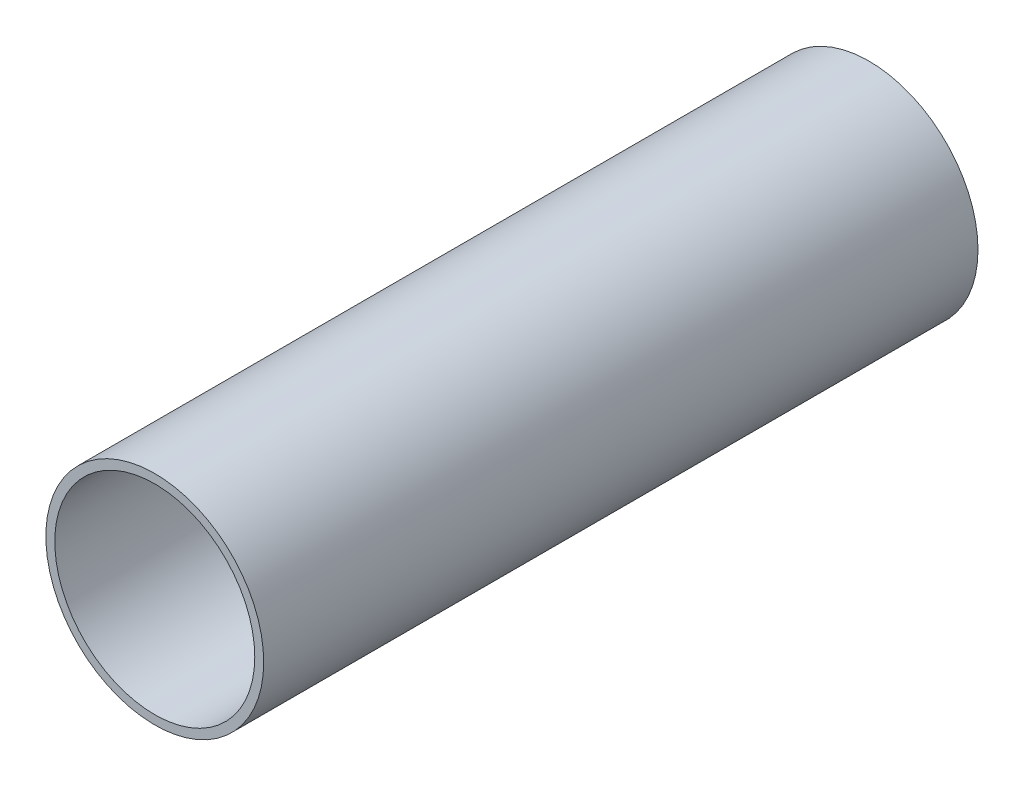
ISO-10303-21;
HEADER;
FILE_DESCRIPTION(('STEP AP214'),'2;1');
FILE_NAME('part.step','',(''),(''),'','','');
FILE_SCHEMA(('AUTOMOTIVE_DESIGN { 1 0 10303 214 1 1 1 1 }'));
ENDSEC;
DATA;
#1=APPLICATION_CONTEXT('core data for automotive mechanical design processes');
#2=APPLICATION_PROTOCOL_DEFINITION('international standard','automotive_design',2000,#1);
#3=PRODUCT_CONTEXT('',#1,'mechanical');
#4=PRODUCT('Part','Part','',(#3));
#5=PRODUCT_RELATED_PRODUCT_CATEGORY('part','',(#4));
#6=PRODUCT_DEFINITION_FORMATION('','',#4);
#7=PRODUCT_DEFINITION_CONTEXT('part definition',#1,'design');
#8=PRODUCT_DEFINITION('design','',#6,#7);
#9=PRODUCT_DEFINITION_SHAPE('','',#8);
#10=(LENGTH_UNIT() NAMED_UNIT(*) SI_UNIT(.MILLI.,.METRE.));
#11=(NAMED_UNIT(*) PLANE_ANGLE_UNIT() SI_UNIT($,.RADIAN.));
#12=(NAMED_UNIT(*) SI_UNIT($,.STERADIAN.) SOLID_ANGLE_UNIT());
#13=UNCERTAINTY_MEASURE_WITH_UNIT(LENGTH_MEASURE(1.E-05),#10,'distance_accuracy_value','');
#14=(GEOMETRIC_REPRESENTATION_CONTEXT(3) GLOBAL_UNCERTAINTY_ASSIGNED_CONTEXT((#13)) GLOBAL_UNIT_ASSIGNED_CONTEXT((#10,
#11,#12)) REPRESENTATION_CONTEXT('',''));
#15=CARTESIAN_POINT('',(0.,0.,0.));
#16=DIRECTION('',(0.,0.,1.));
#17=DIRECTION('',(1.,0.,0.));
#18=AXIS2_PLACEMENT_3D('',#15,#16,#17);
#19=CARTESIAN_POINT('',(0.,0.,50.));
#20=DIRECTION('',(0.,0.,1.));
#21=DIRECTION('',(1.,0.,0.));
#22=AXIS2_PLACEMENT_3D('',#19,#20,#21);
#23=PLANE('',#22);
#24=CARTESIAN_POINT('',(0.,0.,50.));
#25=DIRECTION('',(0.,0.,1.));
#26=DIRECTION('',(1.,0.,0.));
#27=AXIS2_PLACEMENT_3D('',#24,#25,#26);
#28=CIRCLE('',#27,15.25);
#29=CARTESIAN_POINT('',(15.25,0.,50.));
#30=VERTEX_POINT('',#29);
#31=EDGE_CURVE('E10',#30,#30,#28,.T.);
#32=ORIENTED_EDGE('',*,*,#31,.T.);
#33=EDGE_LOOP('',(#32));
#34=FACE_BOUND('',#33,.T.);
#35=CARTESIAN_POINT('',(0.,0.,50.));
#36=DIRECTION('',(0.,0.,1.));
#37=DIRECTION('',(1.,0.,0.));
#38=AXIS2_PLACEMENT_3D('',#35,#36,#37);
#39=CIRCLE('',#38,14.);
#40=CARTESIAN_POINT('',(14.,0.,50.));
#41=VERTEX_POINT('',#40);
#42=EDGE_CURVE('E45',#41,#41,#39,.T.);
#43=ORIENTED_EDGE('',*,*,#42,.F.);
#44=EDGE_LOOP('',(#43));
#45=FACE_BOUND('',#44,.T.);
#46=ADVANCED_FACE('F34',(#34,#45),#23,.T.);
#47=CARTESIAN_POINT('',(0.,0.,-50.));
#48=DIRECTION('',(0.,0.,1.));
#49=DIRECTION('',(1.,0.,0.));
#50=AXIS2_PLACEMENT_3D('',#47,#48,#49);
#51=PLANE('',#50);
#52=CARTESIAN_POINT('',(0.,0.,-50.));
#53=DIRECTION('',(0.,0.,1.));
#54=DIRECTION('',(1.,0.,0.));
#55=AXIS2_PLACEMENT_3D('',#52,#53,#54);
#56=CIRCLE('',#55,15.25);
#57=CARTESIAN_POINT('',(15.25,0.,-50.));
#58=VERTEX_POINT('',#57);
#59=EDGE_CURVE('E38',#58,#58,#56,.T.);
#60=ORIENTED_EDGE('',*,*,#59,.F.);
#61=EDGE_LOOP('',(#60));
#62=FACE_BOUND('',#61,.T.);
#63=CARTESIAN_POINT('',(0.,0.,-50.));
#64=DIRECTION('',(0.,0.,1.));
#65=DIRECTION('',(1.,0.,0.));
#66=AXIS2_PLACEMENT_3D('',#63,#64,#65);
#67=CIRCLE('',#66,14.);
#68=CARTESIAN_POINT('',(14.,0.,-50.));
#69=VERTEX_POINT('',#68);
#70=EDGE_CURVE('E47',#69,#69,#67,.T.);
#71=ORIENTED_EDGE('',*,*,#70,.T.);
#72=EDGE_LOOP('',(#71));
#73=FACE_BOUND('',#72,.T.);
#74=ADVANCED_FACE('F57',(#62,#73),#51,.F.);
#75=CARTESIAN_POINT('',(0.,0.,50.));
#76=DIRECTION('',(0.,0.,-1.));
#77=DIRECTION('',(-1.,0.,0.));
#78=AXIS2_PLACEMENT_3D('',#75,#76,#77);
#79=CYLINDRICAL_SURFACE('',#78,15.25);
#80=ORIENTED_EDGE('',*,*,#31,.F.);
#81=EDGE_LOOP('',(#80));
#82=FACE_BOUND('',#81,.T.);
#83=ORIENTED_EDGE('',*,*,#59,.T.);
#84=EDGE_LOOP('',(#83));
#85=FACE_BOUND('',#84,.T.);
#86=ADVANCED_FACE('F36',(#82,#85),#79,.T.);
#87=CARTESIAN_POINT('',(0.,0.,50.));
#88=DIRECTION('',(0.,0.,-1.));
#89=DIRECTION('',(-1.,0.,0.));
#90=AXIS2_PLACEMENT_3D('',#87,#88,#89);
#91=CYLINDRICAL_SURFACE('',#90,14.);
#92=ORIENTED_EDGE('',*,*,#42,.T.);
#93=EDGE_LOOP('',(#92));
#94=FACE_BOUND('',#93,.T.);
#95=ORIENTED_EDGE('',*,*,#70,.F.);
#96=EDGE_LOOP('',(#95));
#97=FACE_BOUND('',#96,.T.);
#98=ADVANCED_FACE('F53',(#94,#97),#91,.F.);
#99=CLOSED_SHELL('',(#46,#74,#86,#98));
#100=MANIFOLD_SOLID_BREP('B2',#99);
#101=ADVANCED_BREP_SHAPE_REPRESENTATION('',(#18,#100),#14);
#102=SHAPE_DEFINITION_REPRESENTATION(#9,#101);
ENDSEC;
END-ISO-10303-21;
